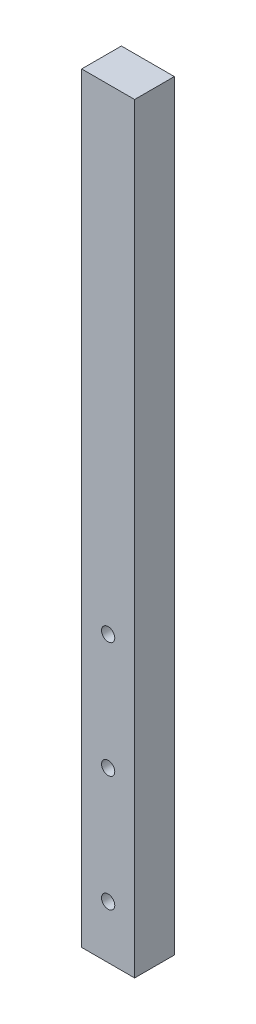
ISO-10303-21;
HEADER;
FILE_DESCRIPTION(('STEP AP214'),'2;1');
FILE_NAME('part.step','',(''),(''),'','','');
FILE_SCHEMA(('AUTOMOTIVE_DESIGN { 1 0 10303 214 1 1 1 1 }'));
ENDSEC;
DATA;
#1=APPLICATION_CONTEXT('core data for automotive mechanical design processes');
#2=APPLICATION_PROTOCOL_DEFINITION('international standard','automotive_design',2000,#1);
#3=PRODUCT_CONTEXT('',#1,'mechanical');
#4=PRODUCT('Part','Part','',(#3));
#5=PRODUCT_RELATED_PRODUCT_CATEGORY('part','',(#4));
#6=PRODUCT_DEFINITION_FORMATION('','',#4);
#7=PRODUCT_DEFINITION_CONTEXT('part definition',#1,'design');
#8=PRODUCT_DEFINITION('design','',#6,#7);
#9=PRODUCT_DEFINITION_SHAPE('','',#8);
#10=(LENGTH_UNIT() NAMED_UNIT(*) SI_UNIT(.MILLI.,.METRE.));
#11=(NAMED_UNIT(*) PLANE_ANGLE_UNIT() SI_UNIT($,.RADIAN.));
#12=(NAMED_UNIT(*) SI_UNIT($,.STERADIAN.) SOLID_ANGLE_UNIT());
#13=UNCERTAINTY_MEASURE_WITH_UNIT(LENGTH_MEASURE(1.E-05),#10,'distance_accuracy_value','');
#14=(GEOMETRIC_REPRESENTATION_CONTEXT(3) GLOBAL_UNCERTAINTY_ASSIGNED_CONTEXT((#13)) GLOBAL_UNIT_ASSIGNED_CONTEXT((#10,
#11,#12)) REPRESENTATION_CONTEXT('',''));
#15=CARTESIAN_POINT('',(0.,0.,0.));
#16=DIRECTION('',(0.,0.,1.));
#17=DIRECTION('',(1.,0.,0.));
#18=AXIS2_PLACEMENT_3D('',#15,#16,#17);
#19=CARTESIAN_POINT('',(0.,0.,6.));
#20=DIRECTION('',(0.,0.,1.));
#21=DIRECTION('',(1.,0.,0.));
#22=AXIS2_PLACEMENT_3D('',#19,#20,#21);
#23=PLANE('',#22);
#24=CARTESIAN_POINT('',(37.1332722892501,32.5854083354087,6.));
#25=DIRECTION('',(0.,0.,1.));
#26=DIRECTION('',(1.,0.,0.));
#27=AXIS2_PLACEMENT_3D('',#24,#25,#26);
#28=CIRCLE('',#27,1.);
#29=CARTESIAN_POINT('',(38.1332722892501,32.5854083354087,6.));
#30=VERTEX_POINT('',#29);
#31=EDGE_CURVE('E193',#30,#30,#28,.T.);
#32=ORIENTED_EDGE('',*,*,#31,.F.);
#33=EDGE_LOOP('',(#32));
#34=FACE_BOUND('',#33,.T.);
#35=DIRECTION('',(1.,0.,0.));
#36=VECTOR('',#35,1.);
#37=CARTESIAN_POINT('',(33.1332722892501,7.08540833540874,6.));
#38=LINE('',#37,#36);
#39=CARTESIAN_POINT('',(33.1332722892501,7.08540833540874,6.));
#40=VERTEX_POINT('',#39);
#41=CARTESIAN_POINT('',(41.1332722892501,7.08540833540874,6.));
#42=VERTEX_POINT('',#41);
#43=EDGE_CURVE('E133',#40,#42,#38,.T.);
#44=ORIENTED_EDGE('',*,*,#43,.T.);
#45=DIRECTION('',(0.,1.,0.));
#46=VECTOR('',#45,1.);
#47=CARTESIAN_POINT('',(41.1332722892501,7.08540833540874,6.));
#48=LINE('',#47,#46);
#49=CARTESIAN_POINT('',(41.1332722892497,122.085408335409,6.));
#50=VERTEX_POINT('',#49);
#51=EDGE_CURVE('E128',#42,#50,#48,.T.);
#52=ORIENTED_EDGE('',*,*,#51,.T.);
#53=DIRECTION('',(1.,0.,0.));
#54=VECTOR('',#53,1.);
#55=CARTESIAN_POINT('',(33.1332722892501,122.085408335409,6.));
#56=LINE('',#55,#54);
#57=CARTESIAN_POINT('',(33.1332722892501,122.085408335409,6.));
#58=VERTEX_POINT('',#57);
#59=EDGE_CURVE('E131',#58,#50,#56,.T.);
#60=ORIENTED_EDGE('',*,*,#59,.F.);
#61=DIRECTION('',(0.,-1.,0.));
#62=VECTOR('',#61,1.);
#63=CARTESIAN_POINT('',(33.1332722892501,122.085408335409,6.));
#64=LINE('',#63,#62);
#65=EDGE_CURVE('E102',#58,#40,#64,.T.);
#66=ORIENTED_EDGE('',*,*,#65,.T.);
#67=EDGE_LOOP('',(#44,#52,#60,#66));
#68=FACE_BOUND('',#67,.T.);
#69=CARTESIAN_POINT('',(37.1332722892501,15.0854083354087,6.));
#70=DIRECTION('',(0.,0.,1.));
#71=DIRECTION('',(1.,0.,0.));
#72=AXIS2_PLACEMENT_3D('',#69,#70,#71);
#73=CIRCLE('',#72,1.);
#74=CARTESIAN_POINT('',(38.1332722892501,15.0854083354087,6.));
#75=VERTEX_POINT('',#74);
#76=EDGE_CURVE('E156',#75,#75,#73,.T.);
#77=ORIENTED_EDGE('',*,*,#76,.F.);
#78=EDGE_LOOP('',(#77));
#79=FACE_BOUND('',#78,.T.);
#80=CARTESIAN_POINT('',(37.1332722892501,50.0854083354087,6.));
#81=DIRECTION('',(0.,0.,1.));
#82=DIRECTION('',(1.,0.,0.));
#83=AXIS2_PLACEMENT_3D('',#80,#81,#82);
#84=CIRCLE('',#83,1.);
#85=CARTESIAN_POINT('',(38.1332722892501,50.0854083354087,6.));
#86=VERTEX_POINT('',#85);
#87=EDGE_CURVE('E187',#86,#86,#84,.T.);
#88=ORIENTED_EDGE('',*,*,#87,.F.);
#89=EDGE_LOOP('',(#88));
#90=FACE_BOUND('',#89,.T.);
#91=ADVANCED_FACE('F84',(#34,#68,#79,#90),#23,.T.);
#92=CARTESIAN_POINT('',(0.,0.,0.));
#93=DIRECTION('',(0.,0.,1.));
#94=DIRECTION('',(1.,0.,0.));
#95=AXIS2_PLACEMENT_3D('',#92,#93,#94);
#96=PLANE('',#95);
#97=DIRECTION('',(1.,0.,0.));
#98=VECTOR('',#97,1.);
#99=CARTESIAN_POINT('',(33.1332722892501,7.08540833540874,0.));
#100=LINE('',#99,#98);
#101=CARTESIAN_POINT('',(33.1332722892501,7.08540833540874,0.));
#102=VERTEX_POINT('',#101);
#103=CARTESIAN_POINT('',(41.1332722892501,7.08540833540874,0.));
#104=VERTEX_POINT('',#103);
#105=EDGE_CURVE('E152',#102,#104,#100,.T.);
#106=ORIENTED_EDGE('',*,*,#105,.F.);
#107=DIRECTION('',(0.,-1.,0.));
#108=VECTOR('',#107,1.);
#109=CARTESIAN_POINT('',(33.1332722892501,122.085408335409,0.));
#110=LINE('',#109,#108);
#111=CARTESIAN_POINT('',(33.1332722892501,122.085408335409,0.));
#112=VERTEX_POINT('',#111);
#113=EDGE_CURVE('E121',#112,#102,#110,.T.);
#114=ORIENTED_EDGE('',*,*,#113,.F.);
#115=DIRECTION('',(1.,0.,0.));
#116=VECTOR('',#115,1.);
#117=CARTESIAN_POINT('',(33.1332722892501,122.085408335409,0.));
#118=LINE('',#117,#116);
#119=CARTESIAN_POINT('',(41.1332722892497,122.085408335409,0.));
#120=VERTEX_POINT('',#119);
#121=EDGE_CURVE('E159',#112,#120,#118,.T.);
#122=ORIENTED_EDGE('',*,*,#121,.T.);
#123=DIRECTION('',(0.,1.,0.));
#124=VECTOR('',#123,1.);
#125=CARTESIAN_POINT('',(41.1332722892501,7.08540833540874,0.));
#126=LINE('',#125,#124);
#127=EDGE_CURVE('E139',#104,#120,#126,.T.);
#128=ORIENTED_EDGE('',*,*,#127,.F.);
#129=EDGE_LOOP('',(#106,#114,#122,#128));
#130=FACE_BOUND('',#129,.T.);
#131=CARTESIAN_POINT('',(37.1332722892501,15.0854083354087,0.));
#132=DIRECTION('',(0.,0.,1.));
#133=DIRECTION('',(1.,0.,0.));
#134=AXIS2_PLACEMENT_3D('',#131,#132,#133);
#135=CIRCLE('',#134,1.);
#136=CARTESIAN_POINT('',(38.1332722892501,15.0854083354087,0.));
#137=VERTEX_POINT('',#136);
#138=EDGE_CURVE('E177',#137,#137,#135,.T.);
#139=ORIENTED_EDGE('',*,*,#138,.T.);
#140=EDGE_LOOP('',(#139));
#141=FACE_BOUND('',#140,.T.);
#142=CARTESIAN_POINT('',(37.1332722892501,32.5854083354087,0.));
#143=DIRECTION('',(0.,0.,1.));
#144=DIRECTION('',(1.,0.,0.));
#145=AXIS2_PLACEMENT_3D('',#142,#143,#144);
#146=CIRCLE('',#145,1.);
#147=CARTESIAN_POINT('',(38.1332722892501,32.5854083354087,0.));
#148=VERTEX_POINT('',#147);
#149=EDGE_CURVE('E181',#148,#148,#146,.T.);
#150=ORIENTED_EDGE('',*,*,#149,.T.);
#151=EDGE_LOOP('',(#150));
#152=FACE_BOUND('',#151,.T.);
#153=CARTESIAN_POINT('',(37.1332722892501,50.0854083354087,0.));
#154=DIRECTION('',(0.,0.,1.));
#155=DIRECTION('',(1.,0.,0.));
#156=AXIS2_PLACEMENT_3D('',#153,#154,#155);
#157=CIRCLE('',#156,1.);
#158=CARTESIAN_POINT('',(38.1332722892501,50.0854083354087,0.));
#159=VERTEX_POINT('',#158);
#160=EDGE_CURVE('E184',#159,#159,#157,.T.);
#161=ORIENTED_EDGE('',*,*,#160,.T.);
#162=EDGE_LOOP('',(#161));
#163=FACE_BOUND('',#162,.T.);
#164=ADVANCED_FACE('F170',(#130,#141,#152,#163),#96,.F.);
#165=CARTESIAN_POINT('',(33.1332722892501,7.08540833540874,6.));
#166=DIRECTION('',(0.,1.,0.));
#167=DIRECTION('',(0.,0.,1.));
#168=AXIS2_PLACEMENT_3D('',#165,#166,#167);
#169=PLANE('',#168);
#170=ORIENTED_EDGE('',*,*,#105,.T.);
#171=DIRECTION('',(0.,0.,-1.));
#172=VECTOR('',#171,1.);
#173=CARTESIAN_POINT('',(41.1332722892501,7.08540833540874,6.));
#174=LINE('',#173,#172);
#175=EDGE_CURVE('E12',#42,#104,#174,.T.);
#176=ORIENTED_EDGE('',*,*,#175,.F.);
#177=ORIENTED_EDGE('',*,*,#43,.F.);
#178=DIRECTION('',(0.,0.,-1.));
#179=VECTOR('',#178,1.);
#180=CARTESIAN_POINT('',(33.1332722892501,7.08540833540874,6.));
#181=LINE('',#180,#179);
#182=EDGE_CURVE('E148',#40,#102,#181,.T.);
#183=ORIENTED_EDGE('',*,*,#182,.T.);
#184=EDGE_LOOP('',(#170,#176,#177,#183));
#185=FACE_BOUND('',#184,.T.);
#186=ADVANCED_FACE('F86',(#185),#169,.F.);
#187=CARTESIAN_POINT('',(41.1332722892501,7.08540833540874,6.));
#188=DIRECTION('',(-1.,0.,0.));
#189=DIRECTION('',(0.,-1.,0.));
#190=AXIS2_PLACEMENT_3D('',#187,#188,#189);
#191=PLANE('',#190);
#192=ORIENTED_EDGE('',*,*,#127,.T.);
#193=DIRECTION('',(0.,0.,-1.));
#194=VECTOR('',#193,1.);
#195=CARTESIAN_POINT('',(41.1332722892497,122.085408335409,6.));
#196=LINE('',#195,#194);
#197=EDGE_CURVE('E94',#50,#120,#196,.T.);
#198=ORIENTED_EDGE('',*,*,#197,.F.);
#199=ORIENTED_EDGE('',*,*,#51,.F.);
#200=ORIENTED_EDGE('',*,*,#175,.T.);
#201=EDGE_LOOP('',(#192,#198,#199,#200));
#202=FACE_BOUND('',#201,.T.);
#203=ADVANCED_FACE('F138',(#202),#191,.F.);
#204=CARTESIAN_POINT('',(33.1332722892501,122.085408335409,6.));
#205=DIRECTION('',(0.,1.,0.));
#206=DIRECTION('',(-1.,0.,0.));
#207=AXIS2_PLACEMENT_3D('',#204,#205,#206);
#208=PLANE('',#207);
#209=ORIENTED_EDGE('',*,*,#121,.F.);
#210=DIRECTION('',(0.,0.,-1.));
#211=VECTOR('',#210,1.);
#212=CARTESIAN_POINT('',(33.1332722892501,122.085408335409,6.));
#213=LINE('',#212,#211);
#214=EDGE_CURVE('E118',#58,#112,#213,.T.);
#215=ORIENTED_EDGE('',*,*,#214,.F.);
#216=ORIENTED_EDGE('',*,*,#59,.T.);
#217=ORIENTED_EDGE('',*,*,#197,.T.);
#218=EDGE_LOOP('',(#209,#215,#216,#217));
#219=FACE_BOUND('',#218,.T.);
#220=ADVANCED_FACE('F144',(#219),#208,.T.);
#221=CARTESIAN_POINT('',(33.1332722892501,122.085408335409,6.));
#222=DIRECTION('',(1.,0.,0.));
#223=DIRECTION('',(0.,0.,-1.));
#224=AXIS2_PLACEMENT_3D('',#221,#222,#223);
#225=PLANE('',#224);
#226=ORIENTED_EDGE('',*,*,#113,.T.);
#227=ORIENTED_EDGE('',*,*,#182,.F.);
#228=ORIENTED_EDGE('',*,*,#65,.F.);
#229=ORIENTED_EDGE('',*,*,#214,.T.);
#230=EDGE_LOOP('',(#226,#227,#228,#229));
#231=FACE_BOUND('',#230,.T.);
#232=ADVANCED_FACE('F225',(#231),#225,.F.);
#233=CARTESIAN_POINT('',(37.1332722892501,15.0854083354087,6.));
#234=DIRECTION('',(0.,0.,-1.));
#235=DIRECTION('',(-1.,0.,0.));
#236=AXIS2_PLACEMENT_3D('',#233,#234,#235);
#237=CYLINDRICAL_SURFACE('',#236,1.);
#238=ORIENTED_EDGE('',*,*,#76,.T.);
#239=EDGE_LOOP('',(#238));
#240=FACE_BOUND('',#239,.T.);
#241=ORIENTED_EDGE('',*,*,#138,.F.);
#242=EDGE_LOOP('',(#241));
#243=FACE_BOUND('',#242,.T.);
#244=ADVANCED_FACE('F206',(#240,#243),#237,.F.);
#245=CARTESIAN_POINT('',(37.1332722892501,32.5854083354087,6.));
#246=DIRECTION('',(0.,0.,-1.));
#247=DIRECTION('',(-1.,0.,0.));
#248=AXIS2_PLACEMENT_3D('',#245,#246,#247);
#249=CYLINDRICAL_SURFACE('',#248,1.);
#250=ORIENTED_EDGE('',*,*,#31,.T.);
#251=EDGE_LOOP('',(#250));
#252=FACE_BOUND('',#251,.T.);
#253=ORIENTED_EDGE('',*,*,#149,.F.);
#254=EDGE_LOOP('',(#253));
#255=FACE_BOUND('',#254,.T.);
#256=ADVANCED_FACE('F216',(#252,#255),#249,.F.);
#257=CARTESIAN_POINT('',(37.1332722892501,50.0854083354087,6.));
#258=DIRECTION('',(0.,0.,-1.));
#259=DIRECTION('',(-1.,0.,0.));
#260=AXIS2_PLACEMENT_3D('',#257,#258,#259);
#261=CYLINDRICAL_SURFACE('',#260,1.);
#262=ORIENTED_EDGE('',*,*,#87,.T.);
#263=EDGE_LOOP('',(#262));
#264=FACE_BOUND('',#263,.T.);
#265=ORIENTED_EDGE('',*,*,#160,.F.);
#266=EDGE_LOOP('',(#265));
#267=FACE_BOUND('',#266,.T.);
#268=ADVANCED_FACE('F214',(#264,#267),#261,.F.);
#269=CLOSED_SHELL('',(#91,#164,#186,#203,#220,#232,#244,#256,#268));
#270=MANIFOLD_SOLID_BREP('B2',#269);
#271=ADVANCED_BREP_SHAPE_REPRESENTATION('',(#18,#270),#14);
#272=SHAPE_DEFINITION_REPRESENTATION(#9,#271);
ENDSEC;
END-ISO-10303-21;
